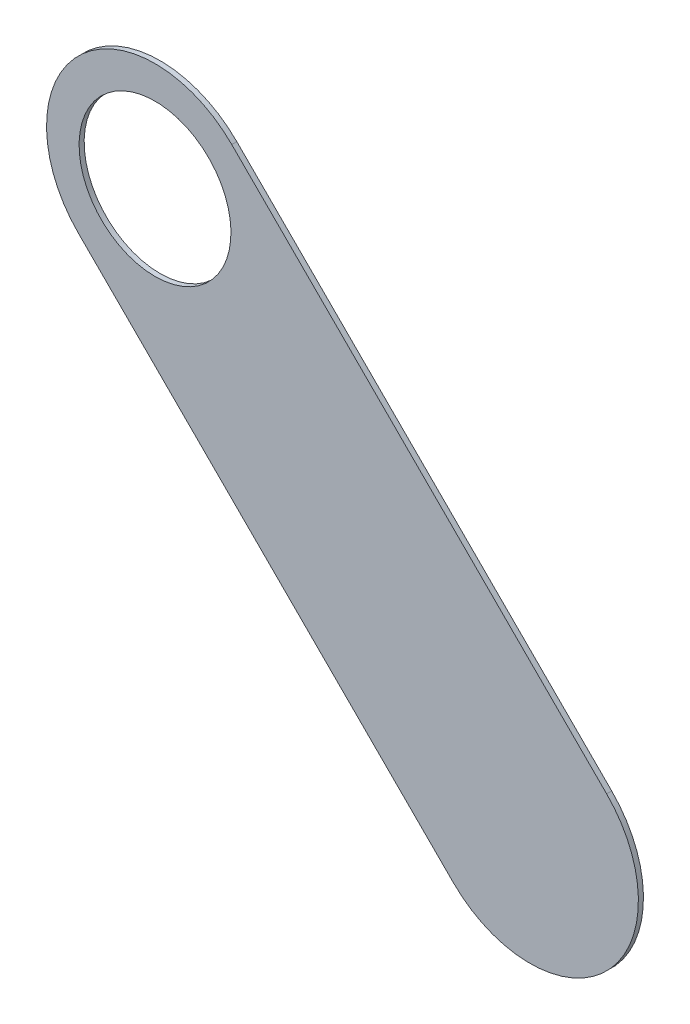
ISO-10303-21;
HEADER;
FILE_DESCRIPTION(('STEP AP214'),'2;1');
FILE_NAME('part.step','',(''),(''),'','','');
FILE_SCHEMA(('AUTOMOTIVE_DESIGN { 1 0 10303 214 1 1 1 1 }'));
ENDSEC;
DATA;
#1=APPLICATION_CONTEXT('core data for automotive mechanical design processes');
#2=APPLICATION_PROTOCOL_DEFINITION('international standard','automotive_design',2000,#1);
#3=PRODUCT_CONTEXT('',#1,'mechanical');
#4=PRODUCT('Part','Part','',(#3));
#5=PRODUCT_RELATED_PRODUCT_CATEGORY('part','',(#4));
#6=PRODUCT_DEFINITION_FORMATION('','',#4);
#7=PRODUCT_DEFINITION_CONTEXT('part definition',#1,'design');
#8=PRODUCT_DEFINITION('design','',#6,#7);
#9=PRODUCT_DEFINITION_SHAPE('','',#8);
#10=(LENGTH_UNIT() NAMED_UNIT(*) SI_UNIT(.MILLI.,.METRE.));
#11=(NAMED_UNIT(*) PLANE_ANGLE_UNIT() SI_UNIT($,.RADIAN.));
#12=(NAMED_UNIT(*) SI_UNIT($,.STERADIAN.) SOLID_ANGLE_UNIT());
#13=UNCERTAINTY_MEASURE_WITH_UNIT(LENGTH_MEASURE(1.E-05),#10,'distance_accuracy_value','');
#14=(GEOMETRIC_REPRESENTATION_CONTEXT(3) GLOBAL_UNCERTAINTY_ASSIGNED_CONTEXT((#13)) GLOBAL_UNIT_ASSIGNED_CONTEXT((#10,
#11,#12)) REPRESENTATION_CONTEXT('',''));
#15=CARTESIAN_POINT('',(0.,0.,0.));
#16=DIRECTION('',(0.,0.,1.));
#17=DIRECTION('',(1.,0.,0.));
#18=AXIS2_PLACEMENT_3D('',#15,#16,#17);
#19=CARTESIAN_POINT('',(158.952,-126.034,-0.045));
#20=DIRECTION('',(0.,0.,-1.));
#21=DIRECTION('',(0.,-1.,0.));
#22=AXIS2_PLACEMENT_3D('',#19,#20,#21);
#23=CYLINDRICAL_SURFACE('',#22,0.525);
#24=CARTESIAN_POINT('',(158.952,-126.034,-0.035));
#25=DIRECTION('',(0.,0.,-1.));
#26=DIRECTION('',(0.,-1.,0.));
#27=AXIS2_PLACEMENT_3D('',#24,#25,#26);
#28=CIRCLE('',#27,0.525);
#29=CARTESIAN_POINT('',(158.952,-126.559,-0.035));
#30=VERTEX_POINT('',#29);
#31=EDGE_CURVE('E86',#30,#30,#28,.T.);
#32=ORIENTED_EDGE('',*,*,#31,.T.);
#33=DIRECTION('',(0.,0.,1.));
#34=VECTOR('',#33,1.);
#35=CARTESIAN_POINT('',(158.952,-126.559,-0.045));
#36=LINE('',#35,#34);
#37=CARTESIAN_POINT('',(158.952,-126.559,0.));
#38=VERTEX_POINT('',#37);
#39=EDGE_CURVE('E11',#30,#38,#36,.T.);
#40=ORIENTED_EDGE('',*,*,#39,.T.);
#41=CARTESIAN_POINT('',(158.952,-126.034,0.));
#42=DIRECTION('',(0.,0.,-1.));
#43=DIRECTION('',(0.,-1.,0.));
#44=AXIS2_PLACEMENT_3D('',#41,#42,#43);
#45=CIRCLE('',#44,0.525);
#46=EDGE_CURVE('E26',#38,#38,#45,.T.);
#47=ORIENTED_EDGE('',*,*,#46,.F.);
#48=ORIENTED_EDGE('',*,*,#39,.F.);
#49=EDGE_LOOP('',(#32,#40,#47,#48));
#50=FACE_BOUND('',#49,.T.);
#51=ADVANCED_FACE('F17',(#50),#23,.F.);
#52=CARTESIAN_POINT('',(162.07433,-128.095669,-0.035));
#53=DIRECTION('',(-0.707106781186548,-0.707106781186548,0.));
#54=DIRECTION('',(-0.707106781186548,0.707106781186548,0.));
#55=AXIS2_PLACEMENT_3D('',#52,#53,#54);
#56=PLANE('',#55);
#57=DIRECTION('',(-0.707106781186548,0.707106781186548,0.));
#58=VECTOR('',#57,1.);
#59=CARTESIAN_POINT('',(162.07433,-128.095669,-0.035));
#60=LINE('',#59,#58);
#61=CARTESIAN_POINT('',(162.07433,-128.095669,-0.035));
#62=VERTEX_POINT('',#61);
#63=CARTESIAN_POINT('',(159.48233,-125.503669,-0.035));
#64=VERTEX_POINT('',#63);
#65=EDGE_CURVE('E68',#62,#64,#60,.T.);
#66=ORIENTED_EDGE('',*,*,#65,.T.);
#67=DIRECTION('',(0.,0.,1.));
#68=VECTOR('',#67,1.);
#69=CARTESIAN_POINT('',(159.48233,-125.503669,-0.035));
#70=LINE('',#69,#68);
#71=CARTESIAN_POINT('',(159.48233,-125.503669,0.));
#72=VERTEX_POINT('',#71);
#73=EDGE_CURVE('E88',#64,#72,#70,.T.);
#74=ORIENTED_EDGE('',*,*,#73,.T.);
#75=DIRECTION('',(-0.707106781186548,0.707106781186548,0.));
#76=VECTOR('',#75,1.);
#77=CARTESIAN_POINT('',(162.07433,-128.095669,0.));
#78=LINE('',#77,#76);
#79=CARTESIAN_POINT('',(162.07433,-128.095669,0.));
#80=VERTEX_POINT('',#79);
#81=EDGE_CURVE('E77',#80,#72,#78,.T.);
#82=ORIENTED_EDGE('',*,*,#81,.F.);
#83=DIRECTION('',(0.,0.,1.));
#84=VECTOR('',#83,1.);
#85=CARTESIAN_POINT('',(162.07433,-128.095669,-0.035));
#86=LINE('',#85,#84);
#87=EDGE_CURVE('E111',#62,#80,#86,.T.);
#88=ORIENTED_EDGE('',*,*,#87,.F.);
#89=EDGE_LOOP('',(#66,#74,#82,#88));
#90=FACE_BOUND('',#89,.T.);
#91=ADVANCED_FACE('F89',(#90),#56,.F.);
#92=CARTESIAN_POINT('',(158.421669,-126.56433,0.));
#93=DIRECTION('',(0.,0.,1.));
#94=DIRECTION('',(1.,0.,0.));
#95=AXIS2_PLACEMENT_3D('',#92,#93,#94);
#96=PLANE('',#95);
#97=ORIENTED_EDGE('',*,*,#46,.T.);
#98=EDGE_LOOP('',(#97));
#99=FACE_BOUND('',#98,.T.);
#100=DIRECTION('',(0.707106781186548,-0.707106781186548,0.));
#101=VECTOR('',#100,1.);
#102=CARTESIAN_POINT('',(158.421669,-126.56433,0.));
#103=LINE('',#102,#101);
#104=CARTESIAN_POINT('',(158.421669,-126.56433,0.));
#105=VERTEX_POINT('',#104);
#106=CARTESIAN_POINT('',(161.013669,-129.15633,0.));
#107=VERTEX_POINT('',#106);
#108=EDGE_CURVE('E126',#105,#107,#103,.T.);
#109=ORIENTED_EDGE('',*,*,#108,.T.);
#110=CARTESIAN_POINT('',(161.5439995,-128.6259995,0.));
#111=DIRECTION('',(0.,0.,1.));
#112=DIRECTION('',(-0.707106781186548,-0.707106781186548,0.));
#113=AXIS2_PLACEMENT_3D('',#110,#111,#112);
#114=CIRCLE('',#113,0.75000058564);
#115=EDGE_CURVE('E83',#107,#80,#114,.T.);
#116=ORIENTED_EDGE('',*,*,#115,.T.);
#117=ORIENTED_EDGE('',*,*,#81,.T.);
#118=CARTESIAN_POINT('',(158.9519995,-126.0339995,0.));
#119=DIRECTION('',(0.,0.,1.));
#120=DIRECTION('',(0.707106781186548,0.707106781186548,0.));
#121=AXIS2_PLACEMENT_3D('',#118,#119,#120);
#122=CIRCLE('',#121,0.75000058564);
#123=EDGE_CURVE('E81',#72,#105,#122,.T.);
#124=ORIENTED_EDGE('',*,*,#123,.T.);
#125=EDGE_LOOP('',(#109,#116,#117,#124));
#126=FACE_BOUND('',#125,.T.);
#127=ADVANCED_FACE('F79',(#99,#126),#96,.T.);
#128=CARTESIAN_POINT('',(158.421669,-126.56433,-0.035));
#129=DIRECTION('',(0.,0.,1.));
#130=DIRECTION('',(1.,0.,0.));
#131=AXIS2_PLACEMENT_3D('',#128,#129,#130);
#132=PLANE('',#131);
#133=ORIENTED_EDGE('',*,*,#31,.F.);
#134=EDGE_LOOP('',(#133));
#135=FACE_BOUND('',#134,.T.);
#136=CARTESIAN_POINT('',(158.9519995,-126.0339995,-0.035));
#137=DIRECTION('',(0.,0.,1.));
#138=DIRECTION('',(0.707106781186548,0.707106781186548,0.));
#139=AXIS2_PLACEMENT_3D('',#136,#137,#138);
#140=CIRCLE('',#139,0.75000058564);
#141=CARTESIAN_POINT('',(158.421669,-126.56433,-0.035));
#142=VERTEX_POINT('',#141);
#143=EDGE_CURVE('E101',#64,#142,#140,.T.);
#144=ORIENTED_EDGE('',*,*,#143,.F.);
#145=ORIENTED_EDGE('',*,*,#65,.F.);
#146=CARTESIAN_POINT('',(161.5439995,-128.6259995,-0.035));
#147=DIRECTION('',(0.,0.,1.));
#148=DIRECTION('',(-0.707106781186548,-0.707106781186548,0.));
#149=AXIS2_PLACEMENT_3D('',#146,#147,#148);
#150=CIRCLE('',#149,0.75000058564);
#151=CARTESIAN_POINT('',(161.013669,-129.15633,-0.035));
#152=VERTEX_POINT('',#151);
#153=EDGE_CURVE('E94',#152,#62,#150,.T.);
#154=ORIENTED_EDGE('',*,*,#153,.F.);
#155=DIRECTION('',(0.707106781186548,-0.707106781186548,0.));
#156=VECTOR('',#155,1.);
#157=CARTESIAN_POINT('',(158.421669,-126.56433,-0.035));
#158=LINE('',#157,#156);
#159=EDGE_CURVE('E134',#142,#152,#158,.T.);
#160=ORIENTED_EDGE('',*,*,#159,.F.);
#161=EDGE_LOOP('',(#144,#145,#154,#160));
#162=FACE_BOUND('',#161,.T.);
#163=ADVANCED_FACE('F146',(#135,#162),#132,.F.);
#164=CARTESIAN_POINT('',(161.5439995,-128.6259995,-0.035));
#165=DIRECTION('',(0.,0.,-1.));
#166=DIRECTION('',(-0.707106781186548,-0.707106781186548,0.));
#167=AXIS2_PLACEMENT_3D('',#164,#165,#166);
#168=CYLINDRICAL_SURFACE('',#167,0.75000058564);
#169=ORIENTED_EDGE('',*,*,#153,.T.);
#170=ORIENTED_EDGE('',*,*,#87,.T.);
#171=ORIENTED_EDGE('',*,*,#115,.F.);
#172=DIRECTION('',(0.,0.,1.));
#173=VECTOR('',#172,1.);
#174=CARTESIAN_POINT('',(161.013669,-129.15633,-0.035));
#175=LINE('',#174,#173);
#176=EDGE_CURVE('E130',#152,#107,#175,.T.);
#177=ORIENTED_EDGE('',*,*,#176,.F.);
#178=EDGE_LOOP('',(#169,#170,#171,#177));
#179=FACE_BOUND('',#178,.T.);
#180=ADVANCED_FACE('F151',(#179),#168,.T.);
#181=CARTESIAN_POINT('',(158.9519995,-126.0339995,-0.035));
#182=DIRECTION('',(0.,0.,-1.));
#183=DIRECTION('',(0.707106781186548,0.707106781186548,0.));
#184=AXIS2_PLACEMENT_3D('',#181,#182,#183);
#185=CYLINDRICAL_SURFACE('',#184,0.75000058564);
#186=ORIENTED_EDGE('',*,*,#143,.T.);
#187=DIRECTION('',(0.,0.,1.));
#188=VECTOR('',#187,1.);
#189=CARTESIAN_POINT('',(158.421669,-126.56433,-0.035));
#190=LINE('',#189,#188);
#191=EDGE_CURVE('E98',#142,#105,#190,.T.);
#192=ORIENTED_EDGE('',*,*,#191,.T.);
#193=ORIENTED_EDGE('',*,*,#123,.F.);
#194=ORIENTED_EDGE('',*,*,#73,.F.);
#195=EDGE_LOOP('',(#186,#192,#193,#194));
#196=FACE_BOUND('',#195,.T.);
#197=ADVANCED_FACE('F96',(#196),#185,.T.);
#198=CARTESIAN_POINT('',(158.421669,-126.56433,-0.035));
#199=DIRECTION('',(0.707106781186548,0.707106781186548,0.));
#200=DIRECTION('',(0.,0.,-1.));
#201=AXIS2_PLACEMENT_3D('',#198,#199,#200);
#202=PLANE('',#201);
#203=ORIENTED_EDGE('',*,*,#159,.T.);
#204=ORIENTED_EDGE('',*,*,#176,.T.);
#205=ORIENTED_EDGE('',*,*,#108,.F.);
#206=ORIENTED_EDGE('',*,*,#191,.F.);
#207=EDGE_LOOP('',(#203,#204,#205,#206));
#208=FACE_BOUND('',#207,.T.);
#209=ADVANCED_FACE('F143',(#208),#202,.F.);
#210=CLOSED_SHELL('',(#51,#91,#127,#163,#180,#197,#209));
#211=MANIFOLD_SOLID_BREP('B1',#210);
#212=ADVANCED_BREP_SHAPE_REPRESENTATION('',(#18,#211),#14);
#213=SHAPE_DEFINITION_REPRESENTATION(#9,#212);
ENDSEC;
END-ISO-10303-21;
